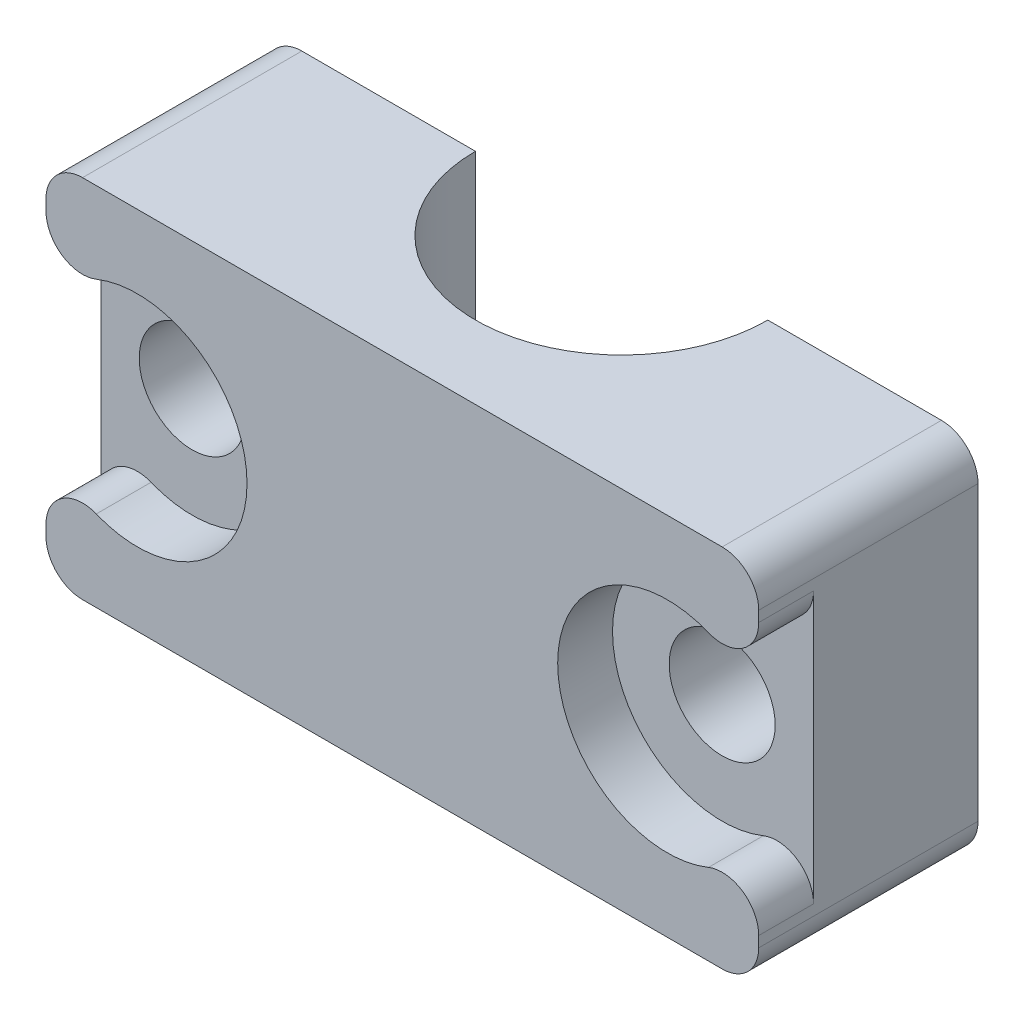
ISO-10303-21;
HEADER;
FILE_DESCRIPTION(('STEP AP214'),'2;1');
FILE_NAME('part.step','',(''),(''),'','','');
FILE_SCHEMA(('AUTOMOTIVE_DESIGN { 1 0 10303 214 1 1 1 1 }'));
ENDSEC;
DATA;
#1=APPLICATION_CONTEXT('core data for automotive mechanical design processes');
#2=APPLICATION_PROTOCOL_DEFINITION('international standard','automotive_design',2000,#1);
#3=PRODUCT_CONTEXT('',#1,'mechanical');
#4=PRODUCT('Part','Part','',(#3));
#5=PRODUCT_RELATED_PRODUCT_CATEGORY('part','',(#4));
#6=PRODUCT_DEFINITION_FORMATION('','',#4);
#7=PRODUCT_DEFINITION_CONTEXT('part definition',#1,'design');
#8=PRODUCT_DEFINITION('design','',#6,#7);
#9=PRODUCT_DEFINITION_SHAPE('','',#8);
#10=(LENGTH_UNIT() NAMED_UNIT(*) SI_UNIT(.MILLI.,.METRE.));
#11=(NAMED_UNIT(*) PLANE_ANGLE_UNIT() SI_UNIT($,.RADIAN.));
#12=(NAMED_UNIT(*) SI_UNIT($,.STERADIAN.) SOLID_ANGLE_UNIT());
#13=UNCERTAINTY_MEASURE_WITH_UNIT(LENGTH_MEASURE(1.E-05),#10,'distance_accuracy_value','');
#14=(GEOMETRIC_REPRESENTATION_CONTEXT(3) GLOBAL_UNCERTAINTY_ASSIGNED_CONTEXT((#13)) GLOBAL_UNIT_ASSIGNED_CONTEXT((#10,
#11,#12)) REPRESENTATION_CONTEXT('',''));
#15=CARTESIAN_POINT('',(0.,0.,0.));
#16=DIRECTION('',(0.,0.,1.));
#17=DIRECTION('',(1.,0.,0.));
#18=AXIS2_PLACEMENT_3D('',#15,#16,#17);
#19=CARTESIAN_POINT('',(0.,-10.9375,16.));
#20=DIRECTION('',(0.,1.,0.));
#21=DIRECTION('',(0.,0.,1.));
#22=AXIS2_PLACEMENT_3D('',#19,#20,#21);
#23=CYLINDRICAL_SURFACE('',#22,4.);
#24=CARTESIAN_POINT('',(0.,-1.,16.));
#25=DIRECTION('',(0.,1.,0.));
#26=DIRECTION('',(0.,0.,1.));
#27=AXIS2_PLACEMENT_3D('',#24,#25,#26);
#28=CIRCLE('',#27,4.);
#29=CARTESIAN_POINT('',(-4.00000000000001,-1.,16.));
#30=VERTEX_POINT('',#29);
#31=CARTESIAN_POINT('',(3.99999999999999,-1.,16.));
#32=VERTEX_POINT('',#31);
#33=EDGE_CURVE('E226',#30,#32,#28,.T.);
#34=ORIENTED_EDGE('',*,*,#33,.T.);
#35=DIRECTION('',(0.,1.,0.));
#36=VECTOR('',#35,1.);
#37=CARTESIAN_POINT('',(3.99999999999999,-10.9375,16.));
#38=LINE('',#37,#36);
#39=CARTESIAN_POINT('',(3.99999999999999,-4.99999999999999,16.));
#40=VERTEX_POINT('',#39);
#41=EDGE_CURVE('E263',#40,#32,#38,.T.);
#42=ORIENTED_EDGE('',*,*,#41,.F.);
#43=CARTESIAN_POINT('',(0.,-5.,16.));
#44=DIRECTION('',(0.,1.,0.));
#45=DIRECTION('',(-1.,0.,0.));
#46=AXIS2_PLACEMENT_3D('',#43,#44,#45);
#47=CIRCLE('',#46,4.);
#48=CARTESIAN_POINT('',(-4.00000000000001,-5.,16.));
#49=VERTEX_POINT('',#48);
#50=EDGE_CURVE('E203',#49,#40,#47,.T.);
#51=ORIENTED_EDGE('',*,*,#50,.F.);
#52=DIRECTION('',(0.,1.,0.));
#53=VECTOR('',#52,1.);
#54=CARTESIAN_POINT('',(-4.00000000000001,-10.9375,16.));
#55=LINE('',#54,#53);
#56=EDGE_CURVE('E250',#30,#49,#55,.F.);
#57=ORIENTED_EDGE('',*,*,#56,.F.);
#58=EDGE_LOOP('',(#34,#42,#51,#57));
#59=FACE_BOUND('',#58,.T.);
#60=ADVANCED_FACE('F42',(#59),#23,.F.);
#61=CARTESIAN_POINT('',(0.,0.,16.));
#62=DIRECTION('',(0.,0.,1.));
#63=DIRECTION('',(1.,0.,0.));
#64=AXIS2_PLACEMENT_3D('',#61,#62,#63);
#65=PLANE('',#64);
#66=CARTESIAN_POINT('',(7.25,0.,16.));
#67=DIRECTION('',(0.,0.,1.));
#68=DIRECTION('',(1.,0.,0.));
#69=AXIS2_PLACEMENT_3D('',#66,#67,#68);
#70=CIRCLE('',#69,1.45);
#71=CARTESIAN_POINT('',(8.7,0.,16.));
#72=VERTEX_POINT('',#71);
#73=EDGE_CURVE('E278',#72,#72,#70,.T.);
#74=ORIENTED_EDGE('',*,*,#73,.T.);
#75=EDGE_LOOP('',(#74));
#76=FACE_BOUND('',#75,.T.);
#77=DIRECTION('',(-1.,0.,0.));
#78=VECTOR('',#77,1.);
#79=CARTESIAN_POINT('',(9.75,4.99999999999999,16.));
#80=LINE('',#79,#78);
#81=CARTESIAN_POINT('',(8.75,4.99999999999999,16.));
#82=VERTEX_POINT('',#81);
#83=CARTESIAN_POINT('',(3.99999999999999,5.,16.));
#84=VERTEX_POINT('',#83);
#85=EDGE_CURVE('E251',#82,#84,#80,.T.);
#86=ORIENTED_EDGE('',*,*,#85,.F.);
#87=CARTESIAN_POINT('',(8.75,3.99999999999999,16.));
#88=DIRECTION('',(0.,0.,1.));
#89=DIRECTION('',(1.,0.,0.));
#90=AXIS2_PLACEMENT_3D('',#87,#88,#89);
#91=CIRCLE('',#90,1.);
#92=CARTESIAN_POINT('',(9.75,3.99999999999999,16.));
#93=VERTEX_POINT('',#92);
#94=EDGE_CURVE('E334',#82,#93,#91,.F.);
#95=ORIENTED_EDGE('',*,*,#94,.T.);
#96=DIRECTION('',(0.,1.,0.));
#97=VECTOR('',#96,1.);
#98=CARTESIAN_POINT('',(9.75000000000001,-4.99999999999999,16.));
#99=LINE('',#98,#97);
#100=CARTESIAN_POINT('',(9.75000000000001,-3.99999999999999,16.));
#101=VERTEX_POINT('',#100);
#102=EDGE_CURVE('E239',#101,#93,#99,.T.);
#103=ORIENTED_EDGE('',*,*,#102,.F.);
#104=CARTESIAN_POINT('',(8.75,-3.99999999999999,16.));
#105=DIRECTION('',(0.,0.,1.));
#106=DIRECTION('',(1.,0.,0.));
#107=AXIS2_PLACEMENT_3D('',#104,#105,#106);
#108=CIRCLE('',#107,1.);
#109=CARTESIAN_POINT('',(8.75,-4.99999999999999,16.));
#110=VERTEX_POINT('',#109);
#111=EDGE_CURVE('E65',#101,#110,#108,.F.);
#112=ORIENTED_EDGE('',*,*,#111,.T.);
#113=DIRECTION('',(1.,0.,0.));
#114=VECTOR('',#113,1.);
#115=CARTESIAN_POINT('',(-9.75,-5.,16.));
#116=LINE('',#115,#114);
#117=EDGE_CURVE('E256',#40,#110,#116,.T.);
#118=ORIENTED_EDGE('',*,*,#117,.F.);
#119=ORIENTED_EDGE('',*,*,#41,.T.);
#120=DIRECTION('',(1.,0.,0.));
#121=VECTOR('',#120,1.);
#122=CARTESIAN_POINT('',(0.,-1.,16.));
#123=LINE('',#122,#121);
#124=CARTESIAN_POINT('',(2.99999999999999,-1.,16.));
#125=VERTEX_POINT('',#124);
#126=EDGE_CURVE('E213',#125,#32,#123,.T.);
#127=ORIENTED_EDGE('',*,*,#126,.F.);
#128=DIRECTION('',(0.,-1.,0.));
#129=VECTOR('',#128,1.);
#130=CARTESIAN_POINT('',(2.99999999999999,1.,16.));
#131=LINE('',#130,#129);
#132=CARTESIAN_POINT('',(2.99999999999999,1.,16.));
#133=VERTEX_POINT('',#132);
#134=EDGE_CURVE('E204',#133,#125,#131,.T.);
#135=ORIENTED_EDGE('',*,*,#134,.F.);
#136=DIRECTION('',(1.,0.,0.));
#137=VECTOR('',#136,1.);
#138=CARTESIAN_POINT('',(0.,1.,16.));
#139=LINE('',#138,#137);
#140=CARTESIAN_POINT('',(3.99999999999999,1.,16.));
#141=VERTEX_POINT('',#140);
#142=EDGE_CURVE('E212',#133,#141,#139,.T.);
#143=ORIENTED_EDGE('',*,*,#142,.T.);
#144=EDGE_CURVE('E262',#141,#84,#38,.T.);
#145=ORIENTED_EDGE('',*,*,#144,.T.);
#146=EDGE_LOOP('',(#86,#95,#103,#112,#118,#119,#127,#135,#143,#145));
#147=FACE_BOUND('',#146,.T.);
#148=ADVANCED_FACE('F374',(#76,#147),#65,.F.);
#149=CARTESIAN_POINT('',(9.75,4.99999999999999,22.));
#150=DIRECTION('',(0.,-1.,0.));
#151=DIRECTION('',(1.,0.,0.));
#152=AXIS2_PLACEMENT_3D('',#149,#150,#151);
#153=PLANE('',#152);
#154=DIRECTION('',(-1.,0.,0.));
#155=VECTOR('',#154,1.);
#156=CARTESIAN_POINT('',(9.75,4.99999999999999,22.));
#157=LINE('',#156,#155);
#158=CARTESIAN_POINT('',(8.75,4.99999999999999,22.));
#159=VERTEX_POINT('',#158);
#160=CARTESIAN_POINT('',(-8.75,5.,22.));
#161=VERTEX_POINT('',#160);
#162=EDGE_CURVE('E235',#159,#161,#157,.T.);
#163=ORIENTED_EDGE('',*,*,#162,.F.);
#164=DIRECTION('',(0.,0.,-1.));
#165=VECTOR('',#164,1.);
#166=CARTESIAN_POINT('',(8.75,4.99999999999999,22.));
#167=LINE('',#166,#165);
#168=EDGE_CURVE('E330',#159,#82,#167,.T.);
#169=ORIENTED_EDGE('',*,*,#168,.T.);
#170=ORIENTED_EDGE('',*,*,#85,.T.);
#171=CARTESIAN_POINT('',(0.,5.,16.));
#172=DIRECTION('',(0.,-1.,0.));
#173=DIRECTION('',(1.,0.,0.));
#174=AXIS2_PLACEMENT_3D('',#171,#172,#173);
#175=CIRCLE('',#174,4.);
#176=CARTESIAN_POINT('',(-4.00000000000001,5.,16.));
#177=VERTEX_POINT('',#176);
#178=EDGE_CURVE('E231',#84,#177,#175,.T.);
#179=ORIENTED_EDGE('',*,*,#178,.T.);
#180=CARTESIAN_POINT('',(-8.75,5.,16.));
#181=VERTEX_POINT('',#180);
#182=EDGE_CURVE('E234',#177,#181,#80,.T.);
#183=ORIENTED_EDGE('',*,*,#182,.T.);
#184=DIRECTION('',(0.,0.,-1.));
#185=VECTOR('',#184,1.);
#186=CARTESIAN_POINT('',(-8.75,5.,22.));
#187=LINE('',#186,#185);
#188=EDGE_CURVE('E328',#181,#161,#187,.F.);
#189=ORIENTED_EDGE('',*,*,#188,.T.);
#190=EDGE_LOOP('',(#163,#169,#170,#179,#183,#189));
#191=FACE_BOUND('',#190,.T.);
#192=ADVANCED_FACE('F381',(#191),#153,.F.);
#193=CARTESIAN_POINT('',(-9.75000000000001,5.,22.));
#194=DIRECTION('',(1.,0.,0.));
#195=DIRECTION('',(0.,1.,0.));
#196=AXIS2_PLACEMENT_3D('',#193,#194,#195);
#197=PLANE('',#196);
#198=DIRECTION('',(0.,1.,0.));
#199=VECTOR('',#198,1.);
#200=CARTESIAN_POINT('',(-9.75000000000001,5.,20.5));
#201=LINE('',#200,#199);
#202=CARTESIAN_POINT('',(-9.75,-3.70809924354784,20.5));
#203=VERTEX_POINT('',#202);
#204=CARTESIAN_POINT('',(-9.75000000000001,3.70809924354783,20.5));
#205=VERTEX_POINT('',#204);
#206=EDGE_CURVE('E273',#203,#205,#201,.T.);
#207=ORIENTED_EDGE('',*,*,#206,.T.);
#208=DIRECTION('',(0.,0.,1.));
#209=VECTOR('',#208,1.);
#210=CARTESIAN_POINT('',(-9.75000000000001,3.70809924354783,22.));
#211=LINE('',#210,#209);
#212=CARTESIAN_POINT('',(-9.75000000000001,3.70809924354783,22.));
#213=VERTEX_POINT('',#212);
#214=EDGE_CURVE('E290',#205,#213,#211,.T.);
#215=ORIENTED_EDGE('',*,*,#214,.T.);
#216=DIRECTION('',(0.,-1.,0.));
#217=VECTOR('',#216,1.);
#218=CARTESIAN_POINT('',(-9.75000000000001,5.,22.));
#219=LINE('',#218,#217);
#220=CARTESIAN_POINT('',(-9.75000000000001,4.,22.));
#221=VERTEX_POINT('',#220);
#222=EDGE_CURVE('E242',#221,#213,#219,.T.);
#223=ORIENTED_EDGE('',*,*,#222,.F.);
#224=DIRECTION('',(0.,0.,-1.));
#225=VECTOR('',#224,1.);
#226=CARTESIAN_POINT('',(-9.75000000000001,4.,22.));
#227=LINE('',#226,#225);
#228=CARTESIAN_POINT('',(-9.75000000000001,4.,16.));
#229=VERTEX_POINT('',#228);
#230=EDGE_CURVE('E284',#221,#229,#227,.T.);
#231=ORIENTED_EDGE('',*,*,#230,.T.);
#232=DIRECTION('',(0.,-1.,0.));
#233=VECTOR('',#232,1.);
#234=CARTESIAN_POINT('',(-9.75000000000001,5.,16.));
#235=LINE('',#234,#233);
#236=CARTESIAN_POINT('',(-9.75,-4.,16.));
#237=VERTEX_POINT('',#236);
#238=EDGE_CURVE('E253',#229,#237,#235,.T.);
#239=ORIENTED_EDGE('',*,*,#238,.T.);
#240=DIRECTION('',(0.,0.,-1.));
#241=VECTOR('',#240,1.);
#242=CARTESIAN_POINT('',(-9.75,-4.,22.));
#243=LINE('',#242,#241);
#244=CARTESIAN_POINT('',(-9.75,-4.,22.));
#245=VERTEX_POINT('',#244);
#246=EDGE_CURVE('E277',#237,#245,#243,.F.);
#247=ORIENTED_EDGE('',*,*,#246,.T.);
#248=CARTESIAN_POINT('',(-9.75,-3.70809924354784,22.));
#249=VERTEX_POINT('',#248);
#250=EDGE_CURVE('E238',#249,#245,#219,.T.);
#251=ORIENTED_EDGE('',*,*,#250,.F.);
#252=DIRECTION('',(0.,0.,1.));
#253=VECTOR('',#252,1.);
#254=CARTESIAN_POINT('',(-9.75,-3.70809924354784,22.));
#255=LINE('',#254,#253);
#256=EDGE_CURVE('E287',#249,#203,#255,.F.);
#257=ORIENTED_EDGE('',*,*,#256,.T.);
#258=EDGE_LOOP('',(#207,#215,#223,#231,#239,#247,#251,#257));
#259=FACE_BOUND('',#258,.T.);
#260=ADVANCED_FACE('F391',(#259),#197,.F.);
#261=CARTESIAN_POINT('',(-9.75,-5.,22.));
#262=DIRECTION('',(0.,1.,0.));
#263=DIRECTION('',(-1.,0.,0.));
#264=AXIS2_PLACEMENT_3D('',#261,#262,#263);
#265=PLANE('',#264);
#266=DIRECTION('',(1.,0.,0.));
#267=VECTOR('',#266,1.);
#268=CARTESIAN_POINT('',(-9.75,-5.,22.));
#269=LINE('',#268,#267);
#270=CARTESIAN_POINT('',(-8.75,-5.,22.));
#271=VERTEX_POINT('',#270);
#272=CARTESIAN_POINT('',(8.75,-4.99999999999999,22.));
#273=VERTEX_POINT('',#272);
#274=EDGE_CURVE('E243',#271,#273,#269,.T.);
#275=ORIENTED_EDGE('',*,*,#274,.F.);
#276=DIRECTION('',(0.,0.,-1.));
#277=VECTOR('',#276,1.);
#278=CARTESIAN_POINT('',(-8.75,-5.,22.));
#279=LINE('',#278,#277);
#280=CARTESIAN_POINT('',(-8.75,-5.,16.));
#281=VERTEX_POINT('',#280);
#282=EDGE_CURVE('E341',#271,#281,#279,.T.);
#283=ORIENTED_EDGE('',*,*,#282,.T.);
#284=EDGE_CURVE('E257',#281,#49,#116,.T.);
#285=ORIENTED_EDGE('',*,*,#284,.T.);
#286=ORIENTED_EDGE('',*,*,#50,.T.);
#287=ORIENTED_EDGE('',*,*,#117,.T.);
#288=DIRECTION('',(0.,0.,-1.));
#289=VECTOR('',#288,1.);
#290=CARTESIAN_POINT('',(8.75,-4.99999999999999,22.));
#291=LINE('',#290,#289);
#292=EDGE_CURVE('E339',#110,#273,#291,.F.);
#293=ORIENTED_EDGE('',*,*,#292,.T.);
#294=EDGE_LOOP('',(#275,#283,#285,#286,#287,#293));
#295=FACE_BOUND('',#294,.T.);
#296=ADVANCED_FACE('F396',(#295),#265,.F.);
#297=CARTESIAN_POINT('',(9.75000000000001,-4.99999999999999,22.));
#298=DIRECTION('',(-1.,0.,0.));
#299=DIRECTION('',(0.,-1.,0.));
#300=AXIS2_PLACEMENT_3D('',#297,#298,#299);
#301=PLANE('',#300);
#302=DIRECTION('',(0.,-1.,0.));
#303=VECTOR('',#302,1.);
#304=CARTESIAN_POINT('',(9.75000000000001,-4.99999999999999,20.5));
#305=LINE('',#304,#303);
#306=CARTESIAN_POINT('',(9.75,3.70809924354783,20.5));
#307=VERTEX_POINT('',#306);
#308=CARTESIAN_POINT('',(9.75000000000001,-3.70809924354783,20.5));
#309=VERTEX_POINT('',#308);
#310=EDGE_CURVE('E275',#307,#309,#305,.T.);
#311=ORIENTED_EDGE('',*,*,#310,.T.);
#312=DIRECTION('',(0.,0.,1.));
#313=VECTOR('',#312,1.);
#314=CARTESIAN_POINT('',(9.75000000000001,-3.70809924354783,22.));
#315=LINE('',#314,#313);
#316=CARTESIAN_POINT('',(9.75000000000001,-3.70809924354783,22.));
#317=VERTEX_POINT('',#316);
#318=EDGE_CURVE('E321',#309,#317,#315,.T.);
#319=ORIENTED_EDGE('',*,*,#318,.T.);
#320=DIRECTION('',(0.,1.,0.));
#321=VECTOR('',#320,1.);
#322=CARTESIAN_POINT('',(9.75000000000001,-4.99999999999999,22.));
#323=LINE('',#322,#321);
#324=CARTESIAN_POINT('',(9.75000000000001,-3.99999999999999,22.));
#325=VERTEX_POINT('',#324);
#326=EDGE_CURVE('E247',#325,#317,#323,.T.);
#327=ORIENTED_EDGE('',*,*,#326,.F.);
#328=DIRECTION('',(0.,0.,-1.));
#329=VECTOR('',#328,1.);
#330=CARTESIAN_POINT('',(9.75000000000001,-3.99999999999999,22.));
#331=LINE('',#330,#329);
#332=EDGE_CURVE('E313',#325,#101,#331,.T.);
#333=ORIENTED_EDGE('',*,*,#332,.T.);
#334=ORIENTED_EDGE('',*,*,#102,.T.);
#335=DIRECTION('',(0.,0.,-1.));
#336=VECTOR('',#335,1.);
#337=CARTESIAN_POINT('',(9.75,3.99999999999999,22.));
#338=LINE('',#337,#336);
#339=CARTESIAN_POINT('',(9.75,3.99999999999999,22.));
#340=VERTEX_POINT('',#339);
#341=EDGE_CURVE('E316',#93,#340,#338,.F.);
#342=ORIENTED_EDGE('',*,*,#341,.T.);
#343=CARTESIAN_POINT('',(9.75,3.70809924354783,22.));
#344=VERTEX_POINT('',#343);
#345=EDGE_CURVE('E246',#344,#340,#323,.T.);
#346=ORIENTED_EDGE('',*,*,#345,.F.);
#347=DIRECTION('',(0.,0.,1.));
#348=VECTOR('',#347,1.);
#349=CARTESIAN_POINT('',(9.75,3.70809924354783,22.));
#350=LINE('',#349,#348);
#351=EDGE_CURVE('E318',#344,#307,#350,.F.);
#352=ORIENTED_EDGE('',*,*,#351,.T.);
#353=EDGE_LOOP('',(#311,#319,#327,#333,#334,#342,#346,#352));
#354=FACE_BOUND('',#353,.T.);
#355=ADVANCED_FACE('F361',(#354),#301,.F.);
#356=CARTESIAN_POINT('',(0.,0.,22.));
#357=DIRECTION('',(0.,0.,1.));
#358=DIRECTION('',(1.,0.,0.));
#359=AXIS2_PLACEMENT_3D('',#356,#357,#358);
#360=PLANE('',#359);
#361=ORIENTED_EDGE('',*,*,#222,.T.);
#362=CARTESIAN_POINT('',(-8.75,3.70809924354783,22.));
#363=DIRECTION('',(0.,0.,1.));
#364=DIRECTION('',(1.,0.,0.));
#365=AXIS2_PLACEMENT_3D('',#362,#363,#364);
#366=CIRCLE('',#365,1.);
#367=CARTESIAN_POINT('',(-8.375,2.78107443266087,22.));
#368=VERTEX_POINT('',#367);
#369=EDGE_CURVE('E307',#213,#368,#366,.T.);
#370=ORIENTED_EDGE('',*,*,#369,.T.);
#371=CARTESIAN_POINT('',(-7.25,0.,22.));
#372=DIRECTION('',(0.,0.,1.));
#373=DIRECTION('',(1.,0.,0.));
#374=AXIS2_PLACEMENT_3D('',#371,#372,#373);
#375=CIRCLE('',#374,3.);
#376=CARTESIAN_POINT('',(-8.375,-2.78107443266088,22.));
#377=VERTEX_POINT('',#376);
#378=EDGE_CURVE('E266',#377,#368,#375,.T.);
#379=ORIENTED_EDGE('',*,*,#378,.F.);
#380=CARTESIAN_POINT('',(-8.75,-3.70809924354783,22.));
#381=DIRECTION('',(0.,0.,1.));
#382=DIRECTION('',(1.,0.,0.));
#383=AXIS2_PLACEMENT_3D('',#380,#381,#382);
#384=CIRCLE('',#383,1.);
#385=EDGE_CURVE('E305',#377,#249,#384,.T.);
#386=ORIENTED_EDGE('',*,*,#385,.T.);
#387=ORIENTED_EDGE('',*,*,#250,.T.);
#388=CARTESIAN_POINT('',(-8.75,-4.,22.));
#389=DIRECTION('',(0.,0.,1.));
#390=DIRECTION('',(1.,0.,0.));
#391=AXIS2_PLACEMENT_3D('',#388,#389,#390);
#392=CIRCLE('',#391,1.);
#393=EDGE_CURVE('E295',#245,#271,#392,.T.);
#394=ORIENTED_EDGE('',*,*,#393,.T.);
#395=ORIENTED_EDGE('',*,*,#274,.T.);
#396=CARTESIAN_POINT('',(8.75,-3.99999999999999,22.));
#397=DIRECTION('',(0.,0.,1.));
#398=DIRECTION('',(1.,0.,0.));
#399=AXIS2_PLACEMENT_3D('',#396,#397,#398);
#400=CIRCLE('',#399,1.);
#401=EDGE_CURVE('E293',#273,#325,#400,.T.);
#402=ORIENTED_EDGE('',*,*,#401,.T.);
#403=ORIENTED_EDGE('',*,*,#326,.T.);
#404=CARTESIAN_POINT('',(8.75,-3.70809924354783,22.));
#405=DIRECTION('',(0.,0.,1.));
#406=DIRECTION('',(1.,0.,0.));
#407=AXIS2_PLACEMENT_3D('',#404,#405,#406);
#408=CIRCLE('',#407,1.);
#409=CARTESIAN_POINT('',(8.375,-2.78107443266087,22.));
#410=VERTEX_POINT('',#409);
#411=EDGE_CURVE('E303',#317,#410,#408,.T.);
#412=ORIENTED_EDGE('',*,*,#411,.T.);
#413=CARTESIAN_POINT('',(7.25,0.,22.));
#414=DIRECTION('',(0.,0.,1.));
#415=DIRECTION('',(1.,0.,0.));
#416=AXIS2_PLACEMENT_3D('',#413,#414,#415);
#417=CIRCLE('',#416,3.);
#418=CARTESIAN_POINT('',(8.375,2.78107443266087,22.));
#419=VERTEX_POINT('',#418);
#420=EDGE_CURVE('E422',#419,#410,#417,.T.);
#421=ORIENTED_EDGE('',*,*,#420,.F.);
#422=CARTESIAN_POINT('',(8.75,3.70809924354783,22.));
#423=DIRECTION('',(0.,0.,1.));
#424=DIRECTION('',(1.,0.,0.));
#425=AXIS2_PLACEMENT_3D('',#422,#423,#424);
#426=CIRCLE('',#425,1.);
#427=EDGE_CURVE('E301',#419,#344,#426,.T.);
#428=ORIENTED_EDGE('',*,*,#427,.T.);
#429=ORIENTED_EDGE('',*,*,#345,.T.);
#430=CARTESIAN_POINT('',(8.75,3.99999999999999,22.));
#431=DIRECTION('',(0.,0.,1.));
#432=DIRECTION('',(1.,0.,0.));
#433=AXIS2_PLACEMENT_3D('',#430,#431,#432);
#434=CIRCLE('',#433,1.);
#435=EDGE_CURVE('E299',#340,#159,#434,.T.);
#436=ORIENTED_EDGE('',*,*,#435,.T.);
#437=ORIENTED_EDGE('',*,*,#162,.T.);
#438=CARTESIAN_POINT('',(-8.75,4.,22.));
#439=DIRECTION('',(0.,0.,1.));
#440=DIRECTION('',(1.,0.,0.));
#441=AXIS2_PLACEMENT_3D('',#438,#439,#440);
#442=CIRCLE('',#441,1.);
#443=EDGE_CURVE('E297',#161,#221,#442,.T.);
#444=ORIENTED_EDGE('',*,*,#443,.T.);
#445=EDGE_LOOP('',(#361,#370,#379,#386,#387,#394,#395,#402,#403,#412,#421,#428,#429,#436,#437,#444));
#446=FACE_BOUND('',#445,.T.);
#447=ADVANCED_FACE('F365',(#446),#360,.T.);
#448=CARTESIAN_POINT('',(-7.25,0.,16.));
#449=DIRECTION('',(0.,0.,1.));
#450=DIRECTION('',(1.,0.,0.));
#451=AXIS2_PLACEMENT_3D('',#448,#449,#450);
#452=CIRCLE('',#451,1.45);
#453=CARTESIAN_POINT('',(-5.8,0.,16.));
#454=VERTEX_POINT('',#453);
#455=EDGE_CURVE('E267',#454,#454,#452,.T.);
#456=ORIENTED_EDGE('',*,*,#455,.T.);
#457=EDGE_LOOP('',(#456));
#458=FACE_BOUND('',#457,.T.);
#459=ORIENTED_EDGE('',*,*,#238,.F.);
#460=CARTESIAN_POINT('',(-8.75,4.,16.));
#461=DIRECTION('',(0.,0.,1.));
#462=DIRECTION('',(1.,0.,0.));
#463=AXIS2_PLACEMENT_3D('',#460,#461,#462);
#464=CIRCLE('',#463,1.);
#465=EDGE_CURVE('E337',#229,#181,#464,.F.);
#466=ORIENTED_EDGE('',*,*,#465,.T.);
#467=ORIENTED_EDGE('',*,*,#182,.F.);
#468=CARTESIAN_POINT('',(-4.00000000000001,1.,16.));
#469=VERTEX_POINT('',#468);
#470=EDGE_CURVE('E219',#177,#469,#55,.F.);
#471=ORIENTED_EDGE('',*,*,#470,.T.);
#472=CARTESIAN_POINT('',(-3.00000000000001,1.,16.));
#473=VERTEX_POINT('',#472);
#474=EDGE_CURVE('E210',#469,#473,#139,.T.);
#475=ORIENTED_EDGE('',*,*,#474,.T.);
#476=DIRECTION('',(0.,-1.,0.));
#477=VECTOR('',#476,1.);
#478=CARTESIAN_POINT('',(-3.00000000000001,1.,16.));
#479=LINE('',#478,#477);
#480=CARTESIAN_POINT('',(-3.00000000000001,-1.,16.));
#481=VERTEX_POINT('',#480);
#482=EDGE_CURVE('E192',#473,#481,#479,.T.);
#483=ORIENTED_EDGE('',*,*,#482,.T.);
#484=EDGE_CURVE('E672',#30,#481,#123,.T.);
#485=ORIENTED_EDGE('',*,*,#484,.F.);
#486=ORIENTED_EDGE('',*,*,#56,.T.);
#487=ORIENTED_EDGE('',*,*,#284,.F.);
#488=CARTESIAN_POINT('',(-8.75,-4.,16.));
#489=DIRECTION('',(0.,0.,1.));
#490=DIRECTION('',(1.,0.,0.));
#491=AXIS2_PLACEMENT_3D('',#488,#489,#490);
#492=CIRCLE('',#491,1.);
#493=EDGE_CURVE('E57',#281,#237,#492,.F.);
#494=ORIENTED_EDGE('',*,*,#493,.T.);
#495=EDGE_LOOP('',(#459,#466,#467,#471,#475,#483,#485,#486,#487,#494));
#496=FACE_BOUND('',#495,.T.);
#497=ADVANCED_FACE('F217',(#458,#496),#65,.F.);
#498=ORIENTED_EDGE('',*,*,#144,.F.);
#499=CARTESIAN_POINT('',(0.,1.,16.));
#500=DIRECTION('',(0.,1.,0.));
#501=DIRECTION('',(0.,0.,1.));
#502=AXIS2_PLACEMENT_3D('',#499,#500,#501);
#503=CIRCLE('',#502,4.);
#504=EDGE_CURVE('E220',#469,#141,#503,.T.);
#505=ORIENTED_EDGE('',*,*,#504,.F.);
#506=ORIENTED_EDGE('',*,*,#470,.F.);
#507=ORIENTED_EDGE('',*,*,#178,.F.);
#508=EDGE_LOOP('',(#498,#505,#506,#507));
#509=FACE_BOUND('',#508,.T.);
#510=ADVANCED_FACE('F442',(#509),#23,.F.);
#511=CARTESIAN_POINT('',(0.,1.,16.));
#512=DIRECTION('',(0.,-1.,0.));
#513=DIRECTION('',(0.,0.,-1.));
#514=AXIS2_PLACEMENT_3D('',#511,#512,#513);
#515=CYLINDRICAL_SURFACE('',#514,3.);
#516=CARTESIAN_POINT('',(0.,-1.,16.));
#517=DIRECTION('',(0.,1.,0.));
#518=DIRECTION('',(0.,0.,1.));
#519=AXIS2_PLACEMENT_3D('',#516,#517,#518);
#520=CIRCLE('',#519,3.);
#521=EDGE_CURVE('E198',#481,#125,#520,.T.);
#522=ORIENTED_EDGE('',*,*,#521,.F.);
#523=ORIENTED_EDGE('',*,*,#482,.F.);
#524=CARTESIAN_POINT('',(0.,1.,16.));
#525=DIRECTION('',(0.,1.,0.));
#526=DIRECTION('',(0.,0.,1.));
#527=AXIS2_PLACEMENT_3D('',#524,#525,#526);
#528=CIRCLE('',#527,3.);
#529=EDGE_CURVE('E195',#473,#133,#528,.T.);
#530=ORIENTED_EDGE('',*,*,#529,.T.);
#531=ORIENTED_EDGE('',*,*,#134,.T.);
#532=EDGE_LOOP('',(#522,#523,#530,#531));
#533=FACE_BOUND('',#532,.T.);
#534=ADVANCED_FACE('F194',(#533),#515,.F.);
#535=CARTESIAN_POINT('',(0.,1.,0.));
#536=DIRECTION('',(0.,1.,0.));
#537=DIRECTION('',(0.,0.,1.));
#538=AXIS2_PLACEMENT_3D('',#535,#536,#537);
#539=PLANE('',#538);
#540=ORIENTED_EDGE('',*,*,#529,.F.);
#541=ORIENTED_EDGE('',*,*,#474,.F.);
#542=ORIENTED_EDGE('',*,*,#504,.T.);
#543=ORIENTED_EDGE('',*,*,#142,.F.);
#544=EDGE_LOOP('',(#540,#541,#542,#543));
#545=FACE_BOUND('',#544,.T.);
#546=ADVANCED_FACE('F208',(#545),#539,.T.);
#547=CARTESIAN_POINT('',(0.,-1.,0.));
#548=DIRECTION('',(0.,1.,0.));
#549=DIRECTION('',(0.,0.,1.));
#550=AXIS2_PLACEMENT_3D('',#547,#548,#549);
#551=PLANE('',#550);
#552=ORIENTED_EDGE('',*,*,#521,.T.);
#553=ORIENTED_EDGE('',*,*,#126,.T.);
#554=ORIENTED_EDGE('',*,*,#33,.F.);
#555=ORIENTED_EDGE('',*,*,#484,.T.);
#556=EDGE_LOOP('',(#552,#553,#554,#555));
#557=FACE_BOUND('',#556,.T.);
#558=ADVANCED_FACE('F536',(#557),#551,.F.);
#559=CARTESIAN_POINT('',(-5.8,0.,20.5));
#560=DIRECTION('',(0.,0.,-1.));
#561=DIRECTION('',(-1.,0.,0.));
#562=AXIS2_PLACEMENT_3D('',#559,#560,#561);
#563=PLANE('',#562);
#564=CARTESIAN_POINT('',(-7.25,0.,20.5));
#565=DIRECTION('',(0.,0.,1.));
#566=DIRECTION('',(1.,0.,0.));
#567=AXIS2_PLACEMENT_3D('',#564,#565,#566);
#568=CIRCLE('',#567,1.45);
#569=CARTESIAN_POINT('',(-5.8,0.,20.5));
#570=VERTEX_POINT('',#569);
#571=EDGE_CURVE('E270',#570,#570,#568,.T.);
#572=ORIENTED_EDGE('',*,*,#571,.F.);
#573=EDGE_LOOP('',(#572));
#574=FACE_BOUND('',#573,.T.);
#575=ORIENTED_EDGE('',*,*,#206,.F.);
#576=CARTESIAN_POINT('',(-8.75,-3.70809924354783,20.5));
#577=DIRECTION('',(0.,0.,-1.));
#578=DIRECTION('',(-1.,0.,0.));
#579=AXIS2_PLACEMENT_3D('',#576,#577,#578);
#580=CIRCLE('',#579,1.);
#581=CARTESIAN_POINT('',(-8.375,-2.78107443266088,20.5));
#582=VERTEX_POINT('',#581);
#583=EDGE_CURVE('E346',#203,#582,#580,.T.);
#584=ORIENTED_EDGE('',*,*,#583,.T.);
#585=CARTESIAN_POINT('',(-7.25,0.,20.5));
#586=DIRECTION('',(0.,0.,1.));
#587=DIRECTION('',(1.,0.,0.));
#588=AXIS2_PLACEMENT_3D('',#585,#586,#587);
#589=CIRCLE('',#588,3.);
#590=CARTESIAN_POINT('',(-8.375,2.78107443266087,20.5));
#591=VERTEX_POINT('',#590);
#592=EDGE_CURVE('E281',#582,#591,#589,.T.);
#593=ORIENTED_EDGE('',*,*,#592,.T.);
#594=CARTESIAN_POINT('',(-8.75,3.70809924354783,20.5));
#595=DIRECTION('',(0.,0.,-1.));
#596=DIRECTION('',(-1.,0.,0.));
#597=AXIS2_PLACEMENT_3D('',#594,#595,#596);
#598=CIRCLE('',#597,1.);
#599=EDGE_CURVE('E343',#591,#205,#598,.T.);
#600=ORIENTED_EDGE('',*,*,#599,.T.);
#601=EDGE_LOOP('',(#575,#584,#593,#600));
#602=FACE_BOUND('',#601,.T.);
#603=ADVANCED_FACE('F410',(#574,#602),#563,.F.);
#604=CARTESIAN_POINT('',(-7.25,0.,22.));
#605=DIRECTION('',(0.,0.,1.));
#606=DIRECTION('',(1.,0.,0.));
#607=AXIS2_PLACEMENT_3D('',#604,#605,#606);
#608=CYLINDRICAL_SURFACE('',#607,3.);
#609=ORIENTED_EDGE('',*,*,#378,.T.);
#610=DIRECTION('',(0.,0.,1.));
#611=VECTOR('',#610,1.);
#612=CARTESIAN_POINT('',(-8.375,2.78107443266087,22.));
#613=LINE('',#612,#611);
#614=EDGE_CURVE('E311',#368,#591,#613,.F.);
#615=ORIENTED_EDGE('',*,*,#614,.T.);
#616=ORIENTED_EDGE('',*,*,#592,.F.);
#617=DIRECTION('',(0.,0.,1.));
#618=VECTOR('',#617,1.);
#619=CARTESIAN_POINT('',(-8.375,-2.78107443266088,22.));
#620=LINE('',#619,#618);
#621=EDGE_CURVE('E309',#582,#377,#620,.T.);
#622=ORIENTED_EDGE('',*,*,#621,.T.);
#623=EDGE_LOOP('',(#609,#615,#616,#622));
#624=FACE_BOUND('',#623,.T.);
#625=ADVANCED_FACE('F413',(#624),#608,.F.);
#626=CARTESIAN_POINT('',(-7.25,0.,22.));
#627=DIRECTION('',(0.,0.,1.));
#628=DIRECTION('',(1.,0.,0.));
#629=AXIS2_PLACEMENT_3D('',#626,#627,#628);
#630=CYLINDRICAL_SURFACE('',#629,1.45);
#631=ORIENTED_EDGE('',*,*,#571,.T.);
#632=EDGE_LOOP('',(#631));
#633=FACE_BOUND('',#632,.T.);
#634=ORIENTED_EDGE('',*,*,#455,.F.);
#635=EDGE_LOOP('',(#634));
#636=FACE_BOUND('',#635,.T.);
#637=ADVANCED_FACE('F515',(#633,#636),#630,.F.);
#638=CARTESIAN_POINT('',(7.25,0.,22.));
#639=DIRECTION('',(0.,0.,1.));
#640=DIRECTION('',(1.,0.,0.));
#641=AXIS2_PLACEMENT_3D('',#638,#639,#640);
#642=CYLINDRICAL_SURFACE('',#641,1.45);
#643=CARTESIAN_POINT('',(7.25,0.,20.5));
#644=DIRECTION('',(0.,0.,1.));
#645=DIRECTION('',(1.,0.,0.));
#646=AXIS2_PLACEMENT_3D('',#643,#644,#645);
#647=CIRCLE('',#646,1.45);
#648=CARTESIAN_POINT('',(8.7,0.,20.5));
#649=VERTEX_POINT('',#648);
#650=EDGE_CURVE('E282',#649,#649,#647,.T.);
#651=ORIENTED_EDGE('',*,*,#650,.T.);
#652=EDGE_LOOP('',(#651));
#653=FACE_BOUND('',#652,.T.);
#654=ORIENTED_EDGE('',*,*,#73,.F.);
#655=EDGE_LOOP('',(#654));
#656=FACE_BOUND('',#655,.T.);
#657=ADVANCED_FACE('F507',(#653,#656),#642,.F.);
#658=CARTESIAN_POINT('',(8.7,0.,20.5));
#659=DIRECTION('',(0.,0.,-1.));
#660=DIRECTION('',(-1.,0.,0.));
#661=AXIS2_PLACEMENT_3D('',#658,#659,#660);
#662=PLANE('',#661);
#663=ORIENTED_EDGE('',*,*,#650,.F.);
#664=EDGE_LOOP('',(#663));
#665=FACE_BOUND('',#664,.T.);
#666=ORIENTED_EDGE('',*,*,#310,.F.);
#667=CARTESIAN_POINT('',(8.75,3.70809924354783,20.5));
#668=DIRECTION('',(0.,0.,-1.));
#669=DIRECTION('',(-1.,0.,0.));
#670=AXIS2_PLACEMENT_3D('',#667,#668,#669);
#671=CIRCLE('',#670,1.);
#672=CARTESIAN_POINT('',(8.375,2.78107443266087,20.5));
#673=VERTEX_POINT('',#672);
#674=EDGE_CURVE('E11',#307,#673,#671,.T.);
#675=ORIENTED_EDGE('',*,*,#674,.T.);
#676=CARTESIAN_POINT('',(7.25,0.,20.5));
#677=DIRECTION('',(0.,0.,1.));
#678=DIRECTION('',(1.,0.,0.));
#679=AXIS2_PLACEMENT_3D('',#676,#677,#678);
#680=CIRCLE('',#679,3.);
#681=CARTESIAN_POINT('',(8.375,-2.78107443266087,20.5));
#682=VERTEX_POINT('',#681);
#683=EDGE_CURVE('E355',#673,#682,#680,.T.);
#684=ORIENTED_EDGE('',*,*,#683,.T.);
#685=CARTESIAN_POINT('',(8.75,-3.70809924354783,20.5));
#686=DIRECTION('',(0.,0.,-1.));
#687=DIRECTION('',(-1.,0.,0.));
#688=AXIS2_PLACEMENT_3D('',#685,#686,#687);
#689=CIRCLE('',#688,1.);
#690=EDGE_CURVE('E50',#682,#309,#689,.T.);
#691=ORIENTED_EDGE('',*,*,#690,.T.);
#692=EDGE_LOOP('',(#666,#675,#684,#691));
#693=FACE_BOUND('',#692,.T.);
#694=ADVANCED_FACE('F352',(#665,#693),#662,.F.);
#695=CARTESIAN_POINT('',(7.25,0.,22.));
#696=DIRECTION('',(0.,0.,1.));
#697=DIRECTION('',(1.,0.,0.));
#698=AXIS2_PLACEMENT_3D('',#695,#696,#697);
#699=CYLINDRICAL_SURFACE('',#698,3.);
#700=ORIENTED_EDGE('',*,*,#420,.T.);
#701=DIRECTION('',(0.,0.,1.));
#702=VECTOR('',#701,1.);
#703=CARTESIAN_POINT('',(8.375,-2.78107443266087,22.));
#704=LINE('',#703,#702);
#705=EDGE_CURVE('E326',#410,#682,#704,.F.);
#706=ORIENTED_EDGE('',*,*,#705,.T.);
#707=ORIENTED_EDGE('',*,*,#683,.F.);
#708=DIRECTION('',(0.,0.,1.));
#709=VECTOR('',#708,1.);
#710=CARTESIAN_POINT('',(8.375,2.78107443266087,22.));
#711=LINE('',#710,#709);
#712=EDGE_CURVE('E324',#673,#419,#711,.T.);
#713=ORIENTED_EDGE('',*,*,#712,.T.);
#714=EDGE_LOOP('',(#700,#706,#707,#713));
#715=FACE_BOUND('',#714,.T.);
#716=ADVANCED_FACE('F424',(#715),#699,.F.);
#717=CARTESIAN_POINT('',(-8.75,3.70809924354783,22.));
#718=DIRECTION('',(0.,0.,1.));
#719=DIRECTION('',(1.,0.,0.));
#720=AXIS2_PLACEMENT_3D('',#717,#718,#719);
#721=CYLINDRICAL_SURFACE('',#720,1.);
#722=ORIENTED_EDGE('',*,*,#599,.F.);
#723=ORIENTED_EDGE('',*,*,#614,.F.);
#724=ORIENTED_EDGE('',*,*,#369,.F.);
#725=ORIENTED_EDGE('',*,*,#214,.F.);
#726=EDGE_LOOP('',(#722,#723,#724,#725));
#727=FACE_BOUND('',#726,.T.);
#728=ADVANCED_FACE('F470',(#727),#721,.T.);
#729=CARTESIAN_POINT('',(-8.75,-3.70809924354783,22.));
#730=DIRECTION('',(0.,0.,1.));
#731=DIRECTION('',(1.,0.,0.));
#732=AXIS2_PLACEMENT_3D('',#729,#730,#731);
#733=CYLINDRICAL_SURFACE('',#732,1.);
#734=ORIENTED_EDGE('',*,*,#385,.F.);
#735=ORIENTED_EDGE('',*,*,#621,.F.);
#736=ORIENTED_EDGE('',*,*,#583,.F.);
#737=ORIENTED_EDGE('',*,*,#256,.F.);
#738=EDGE_LOOP('',(#734,#735,#736,#737));
#739=FACE_BOUND('',#738,.T.);
#740=ADVANCED_FACE('F405',(#739),#733,.T.);
#741=CARTESIAN_POINT('',(8.75,-3.70809924354783,22.));
#742=DIRECTION('',(0.,0.,1.));
#743=DIRECTION('',(1.,0.,0.));
#744=AXIS2_PLACEMENT_3D('',#741,#742,#743);
#745=CYLINDRICAL_SURFACE('',#744,1.);
#746=ORIENTED_EDGE('',*,*,#690,.F.);
#747=ORIENTED_EDGE('',*,*,#705,.F.);
#748=ORIENTED_EDGE('',*,*,#411,.F.);
#749=ORIENTED_EDGE('',*,*,#318,.F.);
#750=EDGE_LOOP('',(#746,#747,#748,#749));
#751=FACE_BOUND('',#750,.T.);
#752=ADVANCED_FACE('F358',(#751),#745,.T.);
#753=CARTESIAN_POINT('',(8.75,3.70809924354783,22.));
#754=DIRECTION('',(0.,0.,1.));
#755=DIRECTION('',(1.,0.,0.));
#756=AXIS2_PLACEMENT_3D('',#753,#754,#755);
#757=CYLINDRICAL_SURFACE('',#756,1.);
#758=ORIENTED_EDGE('',*,*,#427,.F.);
#759=ORIENTED_EDGE('',*,*,#712,.F.);
#760=ORIENTED_EDGE('',*,*,#674,.F.);
#761=ORIENTED_EDGE('',*,*,#351,.F.);
#762=EDGE_LOOP('',(#758,#759,#760,#761));
#763=FACE_BOUND('',#762,.T.);
#764=ADVANCED_FACE('F430',(#763),#757,.T.);
#765=CARTESIAN_POINT('',(8.75,3.99999999999999,22.));
#766=DIRECTION('',(0.,0.,-1.));
#767=DIRECTION('',(-1.,0.,0.));
#768=AXIS2_PLACEMENT_3D('',#765,#766,#767);
#769=CYLINDRICAL_SURFACE('',#768,1.);
#770=ORIENTED_EDGE('',*,*,#435,.F.);
#771=ORIENTED_EDGE('',*,*,#341,.F.);
#772=ORIENTED_EDGE('',*,*,#94,.F.);
#773=ORIENTED_EDGE('',*,*,#168,.F.);
#774=EDGE_LOOP('',(#770,#771,#772,#773));
#775=FACE_BOUND('',#774,.T.);
#776=ADVANCED_FACE('F378',(#775),#769,.T.);
#777=CARTESIAN_POINT('',(-8.75,4.,22.));
#778=DIRECTION('',(0.,0.,-1.));
#779=DIRECTION('',(-1.,0.,0.));
#780=AXIS2_PLACEMENT_3D('',#777,#778,#779);
#781=CYLINDRICAL_SURFACE('',#780,1.);
#782=ORIENTED_EDGE('',*,*,#443,.F.);
#783=ORIENTED_EDGE('',*,*,#188,.F.);
#784=ORIENTED_EDGE('',*,*,#465,.F.);
#785=ORIENTED_EDGE('',*,*,#230,.F.);
#786=EDGE_LOOP('',(#782,#783,#784,#785));
#787=FACE_BOUND('',#786,.T.);
#788=ADVANCED_FACE('F389',(#787),#781,.T.);
#789=CARTESIAN_POINT('',(-8.75,-4.,22.));
#790=DIRECTION('',(0.,0.,-1.));
#791=DIRECTION('',(-1.,0.,0.));
#792=AXIS2_PLACEMENT_3D('',#789,#790,#791);
#793=CYLINDRICAL_SURFACE('',#792,1.);
#794=ORIENTED_EDGE('',*,*,#393,.F.);
#795=ORIENTED_EDGE('',*,*,#246,.F.);
#796=ORIENTED_EDGE('',*,*,#493,.F.);
#797=ORIENTED_EDGE('',*,*,#282,.F.);
#798=EDGE_LOOP('',(#794,#795,#796,#797));
#799=FACE_BOUND('',#798,.T.);
#800=ADVANCED_FACE('F398',(#799),#793,.T.);
#801=CARTESIAN_POINT('',(8.75,-3.99999999999999,22.));
#802=DIRECTION('',(0.,0.,-1.));
#803=DIRECTION('',(-1.,0.,0.));
#804=AXIS2_PLACEMENT_3D('',#801,#802,#803);
#805=CYLINDRICAL_SURFACE('',#804,1.);
#806=ORIENTED_EDGE('',*,*,#401,.F.);
#807=ORIENTED_EDGE('',*,*,#292,.F.);
#808=ORIENTED_EDGE('',*,*,#111,.F.);
#809=ORIENTED_EDGE('',*,*,#332,.F.);
#810=EDGE_LOOP('',(#806,#807,#808,#809));
#811=FACE_BOUND('',#810,.T.);
#812=ADVANCED_FACE('F44',(#811),#805,.T.);
#813=CLOSED_SHELL('',(#60,#148,#192,#260,#296,#355,#447,#497,#510,#534,#546,#558,#603,#625,#637,
#657,#694,#716,#728,#740,#752,#764,#776,#788,#800,#812));
#814=MANIFOLD_SOLID_BREP('B2',#813);
#815=ADVANCED_BREP_SHAPE_REPRESENTATION('',(#18,#814),#14);
#816=SHAPE_DEFINITION_REPRESENTATION(#9,#815);
ENDSEC;
END-ISO-10303-21;
